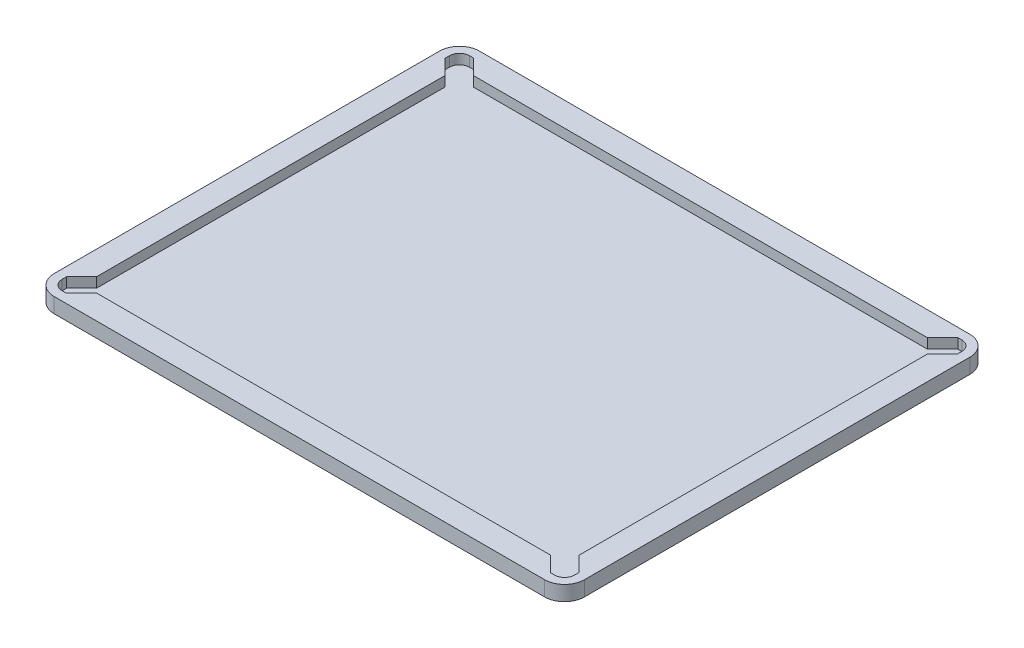
ISO-10303-21;
HEADER;
FILE_DESCRIPTION(('STEP AP214'),'2;1');
FILE_NAME('part.step','',(''),(''),'','','');
FILE_SCHEMA(('AUTOMOTIVE_DESIGN { 1 0 10303 214 1 1 1 1 }'));
ENDSEC;
DATA;
#1=APPLICATION_CONTEXT('core data for automotive mechanical design processes');
#2=APPLICATION_PROTOCOL_DEFINITION('international standard','automotive_design',2000,#1);
#3=PRODUCT_CONTEXT('',#1,'mechanical');
#4=PRODUCT('Part','Part','',(#3));
#5=PRODUCT_RELATED_PRODUCT_CATEGORY('part','',(#4));
#6=PRODUCT_DEFINITION_FORMATION('','',#4);
#7=PRODUCT_DEFINITION_CONTEXT('part definition',#1,'design');
#8=PRODUCT_DEFINITION('design','',#6,#7);
#9=PRODUCT_DEFINITION_SHAPE('','',#8);
#10=(LENGTH_UNIT() NAMED_UNIT(*) SI_UNIT(.MILLI.,.METRE.));
#11=(NAMED_UNIT(*) PLANE_ANGLE_UNIT() SI_UNIT($,.RADIAN.));
#12=(NAMED_UNIT(*) SI_UNIT($,.STERADIAN.) SOLID_ANGLE_UNIT());
#13=UNCERTAINTY_MEASURE_WITH_UNIT(LENGTH_MEASURE(1.E-05),#10,'distance_accuracy_value','');
#14=(GEOMETRIC_REPRESENTATION_CONTEXT(3) GLOBAL_UNCERTAINTY_ASSIGNED_CONTEXT((#13)) GLOBAL_UNIT_ASSIGNED_CONTEXT((#10,
#11,#12)) REPRESENTATION_CONTEXT('',''));
#15=CARTESIAN_POINT('',(0.,0.,0.));
#16=DIRECTION('',(0.,0.,1.));
#17=DIRECTION('',(1.,0.,0.));
#18=AXIS2_PLACEMENT_3D('',#15,#16,#17);
#19=CARTESIAN_POINT('',(0.,7.5,0.));
#20=DIRECTION('',(1.,0.,0.));
#21=DIRECTION('',(0.,0.,-1.));
#22=AXIS2_PLACEMENT_3D('',#19,#20,#21);
#23=PLANE('',#22);
#24=DIRECTION('',(0.,0.,1.));
#25=VECTOR('',#24,1.);
#26=CARTESIAN_POINT('',(0.,0.,0.));
#27=LINE('',#26,#25);
#28=CARTESIAN_POINT('',(0.,0.,-203.3));
#29=VERTEX_POINT('',#28);
#30=CARTESIAN_POINT('',(0.,0.,-10.));
#31=VERTEX_POINT('',#30);
#32=EDGE_CURVE('E288',#29,#31,#27,.T.);
#33=ORIENTED_EDGE('',*,*,#32,.T.);
#34=DIRECTION('',(0.,-1.,0.));
#35=VECTOR('',#34,1.);
#36=CARTESIAN_POINT('',(0.,7.5,-10.));
#37=LINE('',#36,#35);
#38=CARTESIAN_POINT('',(0.,7.5,-10.));
#39=VERTEX_POINT('',#38);
#40=EDGE_CURVE('E11',#31,#39,#37,.F.);
#41=ORIENTED_EDGE('',*,*,#40,.T.);
#42=DIRECTION('',(0.,0.,1.));
#43=VECTOR('',#42,1.);
#44=CARTESIAN_POINT('',(0.,7.5,0.));
#45=LINE('',#44,#43);
#46=CARTESIAN_POINT('',(0.,7.5,-203.3));
#47=VERTEX_POINT('',#46);
#48=EDGE_CURVE('E315',#47,#39,#45,.T.);
#49=ORIENTED_EDGE('',*,*,#48,.F.);
#50=DIRECTION('',(0.,-1.,0.));
#51=VECTOR('',#50,1.);
#52=CARTESIAN_POINT('',(0.,7.5,-203.3));
#53=LINE('',#52,#51);
#54=EDGE_CURVE('E51',#47,#29,#53,.T.);
#55=ORIENTED_EDGE('',*,*,#54,.T.);
#56=EDGE_LOOP('',(#33,#41,#49,#55));
#57=FACE_BOUND('',#56,.T.);
#58=ADVANCED_FACE('F43',(#57),#23,.F.);
#59=CARTESIAN_POINT('',(0.,7.5,0.));
#60=DIRECTION('',(0.,0.,-1.));
#61=DIRECTION('',(-1.,0.,0.));
#62=AXIS2_PLACEMENT_3D('',#59,#60,#61);
#63=PLANE('',#62);
#64=DIRECTION('',(1.,0.,0.));
#65=VECTOR('',#64,1.);
#66=CARTESIAN_POINT('',(0.,0.,0.));
#67=LINE('',#66,#65);
#68=CARTESIAN_POINT('',(10.,0.,0.));
#69=VERTEX_POINT('',#68);
#70=CARTESIAN_POINT('',(256.,0.,0.));
#71=VERTEX_POINT('',#70);
#72=EDGE_CURVE('E293',#69,#71,#67,.T.);
#73=ORIENTED_EDGE('',*,*,#72,.T.);
#74=DIRECTION('',(0.,-1.,0.));
#75=VECTOR('',#74,1.);
#76=CARTESIAN_POINT('',(256.,7.5,0.));
#77=LINE('',#76,#75);
#78=CARTESIAN_POINT('',(256.,7.5,0.));
#79=VERTEX_POINT('',#78);
#80=EDGE_CURVE('E58',#71,#79,#77,.F.);
#81=ORIENTED_EDGE('',*,*,#80,.T.);
#82=DIRECTION('',(1.,0.,0.));
#83=VECTOR('',#82,1.);
#84=CARTESIAN_POINT('',(0.,7.5,0.));
#85=LINE('',#84,#83);
#86=CARTESIAN_POINT('',(10.,7.5,0.));
#87=VERTEX_POINT('',#86);
#88=EDGE_CURVE('E317',#87,#79,#85,.T.);
#89=ORIENTED_EDGE('',*,*,#88,.F.);
#90=DIRECTION('',(0.,-1.,0.));
#91=VECTOR('',#90,1.);
#92=CARTESIAN_POINT('',(10.,7.5,0.));
#93=LINE('',#92,#91);
#94=EDGE_CURVE('E393',#87,#69,#93,.T.);
#95=ORIENTED_EDGE('',*,*,#94,.T.);
#96=EDGE_LOOP('',(#73,#81,#89,#95));
#97=FACE_BOUND('',#96,.T.);
#98=ADVANCED_FACE('F411',(#97),#63,.F.);
#99=CARTESIAN_POINT('',(266.,7.5,0.));
#100=DIRECTION('',(-1.,0.,0.));
#101=DIRECTION('',(0.,0.,1.));
#102=AXIS2_PLACEMENT_3D('',#99,#100,#101);
#103=PLANE('',#102);
#104=DIRECTION('',(0.,0.,-1.));
#105=VECTOR('',#104,1.);
#106=CARTESIAN_POINT('',(266.,0.,0.));
#107=LINE('',#106,#105);
#108=CARTESIAN_POINT('',(266.,0.,-10.));
#109=VERTEX_POINT('',#108);
#110=CARTESIAN_POINT('',(266.,0.,-203.3));
#111=VERTEX_POINT('',#110);
#112=EDGE_CURVE('E328',#109,#111,#107,.T.);
#113=ORIENTED_EDGE('',*,*,#112,.T.);
#114=DIRECTION('',(0.,-1.,0.));
#115=VECTOR('',#114,1.);
#116=CARTESIAN_POINT('',(266.,7.5,-203.3));
#117=LINE('',#116,#115);
#118=CARTESIAN_POINT('',(266.,7.5,-203.3));
#119=VERTEX_POINT('',#118);
#120=EDGE_CURVE('E384',#111,#119,#117,.F.);
#121=ORIENTED_EDGE('',*,*,#120,.T.);
#122=DIRECTION('',(0.,0.,-1.));
#123=VECTOR('',#122,1.);
#124=CARTESIAN_POINT('',(266.,7.5,0.));
#125=LINE('',#124,#123);
#126=CARTESIAN_POINT('',(266.,7.5,-10.));
#127=VERTEX_POINT('',#126);
#128=EDGE_CURVE('E320',#127,#119,#125,.T.);
#129=ORIENTED_EDGE('',*,*,#128,.F.);
#130=DIRECTION('',(0.,-1.,0.));
#131=VECTOR('',#130,1.);
#132=CARTESIAN_POINT('',(266.,7.5,-10.));
#133=LINE('',#132,#131);
#134=EDGE_CURVE('E381',#127,#109,#133,.T.);
#135=ORIENTED_EDGE('',*,*,#134,.T.);
#136=EDGE_LOOP('',(#113,#121,#129,#135));
#137=FACE_BOUND('',#136,.T.);
#138=ADVANCED_FACE('F420',(#137),#103,.F.);
#139=CARTESIAN_POINT('',(0.,7.5,-213.3));
#140=DIRECTION('',(0.,0.,1.));
#141=DIRECTION('',(1.,0.,0.));
#142=AXIS2_PLACEMENT_3D('',#139,#140,#141);
#143=PLANE('',#142);
#144=DIRECTION('',(-1.,0.,0.));
#145=VECTOR('',#144,1.);
#146=CARTESIAN_POINT('',(0.,7.5,-213.3));
#147=LINE('',#146,#145);
#148=CARTESIAN_POINT('',(256.,7.5,-213.3));
#149=VERTEX_POINT('',#148);
#150=CARTESIAN_POINT('',(10.,7.5,-213.3));
#151=VERTEX_POINT('',#150);
#152=EDGE_CURVE('E323',#149,#151,#147,.T.);
#153=ORIENTED_EDGE('',*,*,#152,.F.);
#154=DIRECTION('',(0.,-1.,0.));
#155=VECTOR('',#154,1.);
#156=CARTESIAN_POINT('',(256.,7.5,-213.3));
#157=LINE('',#156,#155);
#158=CARTESIAN_POINT('',(256.,0.,-213.3));
#159=VERTEX_POINT('',#158);
#160=EDGE_CURVE('E370',#149,#159,#157,.T.);
#161=ORIENTED_EDGE('',*,*,#160,.T.);
#162=DIRECTION('',(-1.,0.,0.));
#163=VECTOR('',#162,1.);
#164=CARTESIAN_POINT('',(0.,0.,-213.3));
#165=LINE('',#164,#163);
#166=CARTESIAN_POINT('',(10.,0.,-213.3));
#167=VERTEX_POINT('',#166);
#168=EDGE_CURVE('E318',#159,#167,#165,.T.);
#169=ORIENTED_EDGE('',*,*,#168,.T.);
#170=DIRECTION('',(0.,-1.,0.));
#171=VECTOR('',#170,1.);
#172=CARTESIAN_POINT('',(10.,7.5,-213.3));
#173=LINE('',#172,#171);
#174=EDGE_CURVE('E368',#167,#151,#173,.F.);
#175=ORIENTED_EDGE('',*,*,#174,.T.);
#176=EDGE_LOOP('',(#153,#161,#169,#175));
#177=FACE_BOUND('',#176,.T.);
#178=ADVANCED_FACE('F428',(#177),#143,.F.);
#179=CARTESIAN_POINT('',(0.,7.5,0.));
#180=DIRECTION('',(0.,-1.,0.));
#181=DIRECTION('',(0.,0.,-1.));
#182=AXIS2_PLACEMENT_3D('',#179,#180,#181);
#183=PLANE('',#182);
#184=DIRECTION('',(-1.,0.,0.));
#185=VECTOR('',#184,1.);
#186=CARTESIAN_POINT('',(12.,7.5,-201.15));
#187=LINE('',#186,#185);
#188=CARTESIAN_POINT('',(246.928932188135,7.5,-201.15));
#189=VERTEX_POINT('',#188);
#190=CARTESIAN_POINT('',(19.0710678118655,7.5,-201.15));
#191=VERTEX_POINT('',#190);
#192=EDGE_CURVE('E312',#189,#191,#187,.T.);
#193=ORIENTED_EDGE('',*,*,#192,.F.);
#194=DIRECTION('',(-0.707106781186542,0.,0.707106781186553));
#195=VECTOR('',#194,1.);
#196=CARTESIAN_POINT('',(254.578932188134,7.5,-208.8));
#197=LINE('',#196,#195);
#198=CARTESIAN_POINT('',(254.578932188134,7.5,-208.8));
#199=VERTEX_POINT('',#198);
#200=EDGE_CURVE('E263',#199,#189,#197,.T.);
#201=ORIENTED_EDGE('',*,*,#200,.F.);
#202=DIRECTION('',(-1.,0.,0.));
#203=VECTOR('',#202,1.);
#204=CARTESIAN_POINT('',(261.5,7.5,-208.8));
#205=LINE('',#204,#203);
#206=CARTESIAN_POINT('',(256.5,7.5,-208.8));
#207=VERTEX_POINT('',#206);
#208=EDGE_CURVE('E281',#207,#199,#205,.T.);
#209=ORIENTED_EDGE('',*,*,#208,.F.);
#210=CARTESIAN_POINT('',(256.5,7.5,-203.8));
#211=DIRECTION('',(0.,-1.,0.));
#212=DIRECTION('',(0.,0.,-1.));
#213=AXIS2_PLACEMENT_3D('',#210,#211,#212);
#214=CIRCLE('',#213,5.);
#215=CARTESIAN_POINT('',(261.5,7.5,-203.8));
#216=VERTEX_POINT('',#215);
#217=EDGE_CURVE('E364',#207,#216,#214,.T.);
#218=ORIENTED_EDGE('',*,*,#217,.T.);
#219=DIRECTION('',(0.,0.,-1.));
#220=VECTOR('',#219,1.);
#221=CARTESIAN_POINT('',(261.5,7.5,-201.578932188135));
#222=LINE('',#221,#220);
#223=CARTESIAN_POINT('',(261.5,7.5,-201.578932188135));
#224=VERTEX_POINT('',#223);
#225=EDGE_CURVE('E1044',#224,#216,#222,.T.);
#226=ORIENTED_EDGE('',*,*,#225,.F.);
#227=DIRECTION('',(0.707106781186541,0.,-0.707106781186554));
#228=VECTOR('',#227,1.);
#229=CARTESIAN_POINT('',(254.,7.5,-194.078932188135));
#230=LINE('',#229,#228);
#231=CARTESIAN_POINT('',(254.,7.5,-194.078932188135));
#232=VERTEX_POINT('',#231);
#233=EDGE_CURVE('E1030',#232,#224,#230,.T.);
#234=ORIENTED_EDGE('',*,*,#233,.F.);
#235=DIRECTION('',(0.,0.,-1.));
#236=VECTOR('',#235,1.);
#237=CARTESIAN_POINT('',(254.,7.5,-201.15));
#238=LINE('',#237,#236);
#239=CARTESIAN_POINT('',(254.,7.5,-19.2210678118655));
#240=VERTEX_POINT('',#239);
#241=EDGE_CURVE('E308',#240,#232,#238,.T.);
#242=ORIENTED_EDGE('',*,*,#241,.F.);
#243=DIRECTION('',(-0.70710678118654,0.,-0.707106781186555));
#244=VECTOR('',#243,1.);
#245=CARTESIAN_POINT('',(254.,7.5,-19.2210678118655));
#246=LINE('',#245,#244);
#247=CARTESIAN_POINT('',(261.5,7.5,-11.7210678118653));
#248=VERTEX_POINT('',#247);
#249=EDGE_CURVE('E1017',#248,#240,#246,.T.);
#250=ORIENTED_EDGE('',*,*,#249,.F.);
#251=DIRECTION('',(0.,0.,-1.));
#252=VECTOR('',#251,1.);
#253=CARTESIAN_POINT('',(261.5,7.5,-11.7210678118653));
#254=LINE('',#253,#252);
#255=CARTESIAN_POINT('',(261.5,7.5,-9.50000000000003));
#256=VERTEX_POINT('',#255);
#257=EDGE_CURVE('E1010',#256,#248,#254,.T.);
#258=ORIENTED_EDGE('',*,*,#257,.F.);
#259=CARTESIAN_POINT('',(256.5,7.5,-9.50000000000003));
#260=DIRECTION('',(0.,-1.,0.));
#261=DIRECTION('',(0.,0.,-1.));
#262=AXIS2_PLACEMENT_3D('',#259,#260,#261);
#263=CIRCLE('',#262,5.);
#264=CARTESIAN_POINT('',(256.5,7.5,-4.50000000000002));
#265=VERTEX_POINT('',#264);
#266=EDGE_CURVE('E362',#256,#265,#263,.T.);
#267=ORIENTED_EDGE('',*,*,#266,.T.);
#268=DIRECTION('',(1.,0.,0.));
#269=VECTOR('',#268,1.);
#270=CARTESIAN_POINT('',(261.5,7.5,-4.5));
#271=LINE('',#270,#269);
#272=CARTESIAN_POINT('',(254.578932188134,7.5,-4.50000000000003));
#273=VERTEX_POINT('',#272);
#274=EDGE_CURVE('E1007',#273,#265,#271,.T.);
#275=ORIENTED_EDGE('',*,*,#274,.F.);
#276=DIRECTION('',(0.707106781186542,0.,0.707106781186553));
#277=VECTOR('',#276,1.);
#278=CARTESIAN_POINT('',(254.578932188134,7.5,-4.50000000000003));
#279=LINE('',#278,#277);
#280=CARTESIAN_POINT('',(246.928932188135,7.5,-12.15));
#281=VERTEX_POINT('',#280);
#282=EDGE_CURVE('E1005',#281,#273,#279,.T.);
#283=ORIENTED_EDGE('',*,*,#282,.F.);
#284=DIRECTION('',(1.,0.,0.));
#285=VECTOR('',#284,1.);
#286=CARTESIAN_POINT('',(12.,7.5,-12.1500000000001));
#287=LINE('',#286,#285);
#288=CARTESIAN_POINT('',(19.0710678118655,7.5,-12.15));
#289=VERTEX_POINT('',#288);
#290=EDGE_CURVE('E304',#289,#281,#287,.T.);
#291=ORIENTED_EDGE('',*,*,#290,.F.);
#292=DIRECTION('',(0.707106781186542,0.,-0.707106781186553));
#293=VECTOR('',#292,1.);
#294=CARTESIAN_POINT('',(11.4210678118656,7.5,-4.50000000000003));
#295=LINE('',#294,#293);
#296=CARTESIAN_POINT('',(11.4210678118656,7.5,-4.50000000000003));
#297=VERTEX_POINT('',#296);
#298=EDGE_CURVE('E949',#297,#289,#295,.T.);
#299=ORIENTED_EDGE('',*,*,#298,.F.);
#300=DIRECTION('',(1.,0.,0.));
#301=VECTOR('',#300,1.);
#302=CARTESIAN_POINT('',(4.5,7.5,-4.5));
#303=LINE('',#302,#301);
#304=CARTESIAN_POINT('',(9.50000000000002,7.5,-4.50000000000002));
#305=VERTEX_POINT('',#304);
#306=EDGE_CURVE('E942',#305,#297,#303,.T.);
#307=ORIENTED_EDGE('',*,*,#306,.F.);
#308=CARTESIAN_POINT('',(9.5,7.5,-9.50000000000003));
#309=DIRECTION('',(0.,-1.,0.));
#310=DIRECTION('',(0.,0.,-1.));
#311=AXIS2_PLACEMENT_3D('',#308,#309,#310);
#312=CIRCLE('',#311,5.);
#313=CARTESIAN_POINT('',(4.5,7.5,-9.50000000000003));
#314=VERTEX_POINT('',#313);
#315=EDGE_CURVE('E360',#305,#314,#312,.T.);
#316=ORIENTED_EDGE('',*,*,#315,.T.);
#317=DIRECTION('',(0.,0.,1.));
#318=VECTOR('',#317,1.);
#319=CARTESIAN_POINT('',(4.5,7.5,-11.7210678118653));
#320=LINE('',#319,#318);
#321=CARTESIAN_POINT('',(4.5,7.5,-11.7210678118653));
#322=VERTEX_POINT('',#321);
#323=EDGE_CURVE('E955',#322,#314,#320,.T.);
#324=ORIENTED_EDGE('',*,*,#323,.F.);
#325=DIRECTION('',(-0.70710678118654,0.,0.707106781186555));
#326=VECTOR('',#325,1.);
#327=CARTESIAN_POINT('',(12.,7.5,-19.2210678118655));
#328=LINE('',#327,#326);
#329=CARTESIAN_POINT('',(12.,7.5,-19.2210678118655));
#330=VERTEX_POINT('',#329);
#331=EDGE_CURVE('E951',#330,#322,#328,.T.);
#332=ORIENTED_EDGE('',*,*,#331,.F.);
#333=DIRECTION('',(0.,0.,1.));
#334=VECTOR('',#333,1.);
#335=CARTESIAN_POINT('',(12.,7.5,-201.15));
#336=LINE('',#335,#334);
#337=CARTESIAN_POINT('',(12.,7.5,-194.078932188135));
#338=VERTEX_POINT('',#337);
#339=EDGE_CURVE('E301',#338,#330,#336,.T.);
#340=ORIENTED_EDGE('',*,*,#339,.F.);
#341=DIRECTION('',(0.707106781186541,0.,0.707106781186554));
#342=VECTOR('',#341,1.);
#343=CARTESIAN_POINT('',(12.,7.5,-194.078932188135));
#344=LINE('',#343,#342);
#345=CARTESIAN_POINT('',(4.5,7.5,-201.578932188135));
#346=VERTEX_POINT('',#345);
#347=EDGE_CURVE('E969',#346,#338,#344,.T.);
#348=ORIENTED_EDGE('',*,*,#347,.F.);
#349=DIRECTION('',(0.,0.,1.));
#350=VECTOR('',#349,1.);
#351=CARTESIAN_POINT('',(4.5,7.5,-201.578932188135));
#352=LINE('',#351,#350);
#353=CARTESIAN_POINT('',(4.5,7.5,-203.8));
#354=VERTEX_POINT('',#353);
#355=EDGE_CURVE('E977',#354,#346,#352,.T.);
#356=ORIENTED_EDGE('',*,*,#355,.F.);
#357=CARTESIAN_POINT('',(9.5,7.5,-203.8));
#358=DIRECTION('',(0.,-1.,0.));
#359=DIRECTION('',(0.,0.,-1.));
#360=AXIS2_PLACEMENT_3D('',#357,#358,#359);
#361=CIRCLE('',#360,5.);
#362=CARTESIAN_POINT('',(9.5,7.5,-208.8));
#363=VERTEX_POINT('',#362);
#364=EDGE_CURVE('E366',#354,#363,#361,.T.);
#365=ORIENTED_EDGE('',*,*,#364,.T.);
#366=DIRECTION('',(-1.,0.,0.));
#367=VECTOR('',#366,1.);
#368=CARTESIAN_POINT('',(4.5,7.5,-208.8));
#369=LINE('',#368,#367);
#370=CARTESIAN_POINT('',(11.4210678118656,7.5,-208.8));
#371=VERTEX_POINT('',#370);
#372=EDGE_CURVE('E974',#371,#363,#369,.T.);
#373=ORIENTED_EDGE('',*,*,#372,.F.);
#374=DIRECTION('',(-0.707106781186542,0.,-0.707106781186552));
#375=VECTOR('',#374,1.);
#376=CARTESIAN_POINT('',(11.4210678118656,7.5,-208.8));
#377=LINE('',#376,#375);
#378=EDGE_CURVE('E902',#191,#371,#377,.T.);
#379=ORIENTED_EDGE('',*,*,#378,.F.);
#380=EDGE_LOOP('',(#193,#201,#209,#218,#226,#234,#242,#250,#258,#267,#275,#283,#291,#299,#307,
#316,#324,#332,#340,#348,#356,#365,#373,#379));
#381=FACE_BOUND('',#380,.T.);
#382=ORIENTED_EDGE('',*,*,#128,.T.);
#383=CARTESIAN_POINT('',(256.,7.5,-203.3));
#384=DIRECTION('',(0.,-1.,0.));
#385=DIRECTION('',(0.,0.,-1.));
#386=AXIS2_PLACEMENT_3D('',#383,#384,#385);
#387=CIRCLE('',#386,10.);
#388=EDGE_CURVE('E391',#119,#149,#387,.F.);
#389=ORIENTED_EDGE('',*,*,#388,.T.);
#390=ORIENTED_EDGE('',*,*,#152,.T.);
#391=CARTESIAN_POINT('',(10.,7.5,-203.3));
#392=DIRECTION('',(0.,-1.,0.));
#393=DIRECTION('',(0.,0.,-1.));
#394=AXIS2_PLACEMENT_3D('',#391,#392,#393);
#395=CIRCLE('',#394,10.);
#396=EDGE_CURVE('E386',#151,#47,#395,.F.);
#397=ORIENTED_EDGE('',*,*,#396,.T.);
#398=ORIENTED_EDGE('',*,*,#48,.T.);
#399=CARTESIAN_POINT('',(10.,7.5,-10.));
#400=DIRECTION('',(0.,-1.,0.));
#401=DIRECTION('',(0.,0.,-1.));
#402=AXIS2_PLACEMENT_3D('',#399,#400,#401);
#403=CIRCLE('',#402,10.);
#404=EDGE_CURVE('E65',#39,#87,#403,.F.);
#405=ORIENTED_EDGE('',*,*,#404,.T.);
#406=ORIENTED_EDGE('',*,*,#88,.T.);
#407=CARTESIAN_POINT('',(256.,7.5,-10.));
#408=DIRECTION('',(0.,-1.,0.));
#409=DIRECTION('',(0.,0.,-1.));
#410=AXIS2_PLACEMENT_3D('',#407,#408,#409);
#411=CIRCLE('',#410,10.);
#412=EDGE_CURVE('E389',#79,#127,#411,.F.);
#413=ORIENTED_EDGE('',*,*,#412,.T.);
#414=EDGE_LOOP('',(#382,#389,#390,#397,#398,#405,#406,#413));
#415=FACE_BOUND('',#414,.T.);
#416=ADVANCED_FACE('F413',(#381,#415),#183,.F.);
#417=CARTESIAN_POINT('',(0.,0.,0.));
#418=DIRECTION('',(0.,-1.,0.));
#419=DIRECTION('',(0.,0.,-1.));
#420=AXIS2_PLACEMENT_3D('',#417,#418,#419);
#421=PLANE('',#420);
#422=ORIENTED_EDGE('',*,*,#168,.F.);
#423=CARTESIAN_POINT('',(256.,0.,-203.3));
#424=DIRECTION('',(0.,-1.,0.));
#425=DIRECTION('',(0.,0.,-1.));
#426=AXIS2_PLACEMENT_3D('',#423,#424,#425);
#427=CIRCLE('',#426,10.);
#428=EDGE_CURVE('E379',#159,#111,#427,.T.);
#429=ORIENTED_EDGE('',*,*,#428,.T.);
#430=ORIENTED_EDGE('',*,*,#112,.F.);
#431=CARTESIAN_POINT('',(256.,0.,-10.));
#432=DIRECTION('',(0.,-1.,0.));
#433=DIRECTION('',(0.,0.,-1.));
#434=AXIS2_PLACEMENT_3D('',#431,#432,#433);
#435=CIRCLE('',#434,10.);
#436=EDGE_CURVE('E377',#109,#71,#435,.T.);
#437=ORIENTED_EDGE('',*,*,#436,.T.);
#438=ORIENTED_EDGE('',*,*,#72,.F.);
#439=CARTESIAN_POINT('',(10.,0.,-10.));
#440=DIRECTION('',(0.,-1.,0.));
#441=DIRECTION('',(0.,0.,-1.));
#442=AXIS2_PLACEMENT_3D('',#439,#440,#441);
#443=CIRCLE('',#442,10.);
#444=EDGE_CURVE('E375',#69,#31,#443,.T.);
#445=ORIENTED_EDGE('',*,*,#444,.T.);
#446=ORIENTED_EDGE('',*,*,#32,.F.);
#447=CARTESIAN_POINT('',(10.,0.,-203.3));
#448=DIRECTION('',(0.,-1.,0.));
#449=DIRECTION('',(0.,0.,-1.));
#450=AXIS2_PLACEMENT_3D('',#447,#448,#449);
#451=CIRCLE('',#450,10.);
#452=EDGE_CURVE('E373',#29,#167,#451,.T.);
#453=ORIENTED_EDGE('',*,*,#452,.T.);
#454=EDGE_LOOP('',(#422,#429,#430,#437,#438,#445,#446,#453));
#455=FACE_BOUND('',#454,.T.);
#456=ADVANCED_FACE('F406',(#455),#421,.T.);
#457=CARTESIAN_POINT('',(12.,2.5,-201.15));
#458=DIRECTION('',(-1.,0.,0.));
#459=DIRECTION('',(0.,0.,1.));
#460=AXIS2_PLACEMENT_3D('',#457,#458,#459);
#461=PLANE('',#460);
#462=ORIENTED_EDGE('',*,*,#339,.T.);
#463=DIRECTION('',(0.,1.,0.));
#464=VECTOR('',#463,1.);
#465=CARTESIAN_POINT('',(12.,2.5,-19.2210678118655));
#466=LINE('',#465,#464);
#467=CARTESIAN_POINT('',(12.,2.5,-19.2210678118655));
#468=VERTEX_POINT('',#467);
#469=EDGE_CURVE('E964',#468,#330,#466,.T.);
#470=ORIENTED_EDGE('',*,*,#469,.F.);
#471=DIRECTION('',(0.,0.,1.));
#472=VECTOR('',#471,1.);
#473=CARTESIAN_POINT('',(12.,2.5,-201.15));
#474=LINE('',#473,#472);
#475=CARTESIAN_POINT('',(12.,2.5,-194.078932188135));
#476=VERTEX_POINT('',#475);
#477=EDGE_CURVE('E314',#476,#468,#474,.T.);
#478=ORIENTED_EDGE('',*,*,#477,.F.);
#479=DIRECTION('',(0.,1.,0.));
#480=VECTOR('',#479,1.);
#481=CARTESIAN_POINT('',(12.,2.5,-194.078932188135));
#482=LINE('',#481,#480);
#483=EDGE_CURVE('E305',#476,#338,#482,.T.);
#484=ORIENTED_EDGE('',*,*,#483,.T.);
#485=EDGE_LOOP('',(#462,#470,#478,#484));
#486=FACE_BOUND('',#485,.T.);
#487=ADVANCED_FACE('F662',(#486),#461,.F.);
#488=CARTESIAN_POINT('',(12.,2.5,-201.15));
#489=DIRECTION('',(0.,0.,-1.));
#490=DIRECTION('',(-1.,0.,0.));
#491=AXIS2_PLACEMENT_3D('',#488,#489,#490);
#492=PLANE('',#491);
#493=DIRECTION('',(-1.,0.,0.));
#494=VECTOR('',#493,1.);
#495=CARTESIAN_POINT('',(12.,2.5,-201.15));
#496=LINE('',#495,#494);
#497=CARTESIAN_POINT('',(246.928932188135,2.5,-201.15));
#498=VERTEX_POINT('',#497);
#499=CARTESIAN_POINT('',(19.0710678118655,2.5,-201.15));
#500=VERTEX_POINT('',#499);
#501=EDGE_CURVE('E275',#498,#500,#496,.T.);
#502=ORIENTED_EDGE('',*,*,#501,.F.);
#503=DIRECTION('',(0.,1.,0.));
#504=VECTOR('',#503,1.);
#505=CARTESIAN_POINT('',(246.928932188135,2.5,-201.15));
#506=LINE('',#505,#504);
#507=EDGE_CURVE('E257',#498,#189,#506,.T.);
#508=ORIENTED_EDGE('',*,*,#507,.T.);
#509=ORIENTED_EDGE('',*,*,#192,.T.);
#510=DIRECTION('',(0.,1.,0.));
#511=VECTOR('',#510,1.);
#512=CARTESIAN_POINT('',(19.0710678118655,2.5,-201.15));
#513=LINE('',#512,#511);
#514=EDGE_CURVE('E286',#500,#191,#513,.T.);
#515=ORIENTED_EDGE('',*,*,#514,.F.);
#516=EDGE_LOOP('',(#502,#508,#509,#515));
#517=FACE_BOUND('',#516,.T.);
#518=ADVANCED_FACE('F284',(#517),#492,.F.);
#519=CARTESIAN_POINT('',(254.,2.5,-201.15));
#520=DIRECTION('',(1.,0.,0.));
#521=DIRECTION('',(0.,0.,-1.));
#522=AXIS2_PLACEMENT_3D('',#519,#520,#521);
#523=PLANE('',#522);
#524=ORIENTED_EDGE('',*,*,#241,.T.);
#525=DIRECTION('',(0.,1.,0.));
#526=VECTOR('',#525,1.);
#527=CARTESIAN_POINT('',(254.,2.5,-194.078932188135));
#528=LINE('',#527,#526);
#529=CARTESIAN_POINT('',(254.,2.5,-194.078932188135));
#530=VERTEX_POINT('',#529);
#531=EDGE_CURVE('E268',#530,#232,#528,.T.);
#532=ORIENTED_EDGE('',*,*,#531,.F.);
#533=DIRECTION('',(0.,0.,-1.));
#534=VECTOR('',#533,1.);
#535=CARTESIAN_POINT('',(254.,2.5,-201.15));
#536=LINE('',#535,#534);
#537=CARTESIAN_POINT('',(254.,2.5,-19.2210678118655));
#538=VERTEX_POINT('',#537);
#539=EDGE_CURVE('E289',#538,#530,#536,.T.);
#540=ORIENTED_EDGE('',*,*,#539,.F.);
#541=DIRECTION('',(0.,1.,0.));
#542=VECTOR('',#541,1.);
#543=CARTESIAN_POINT('',(254.,2.5,-19.2210678118655));
#544=LINE('',#543,#542);
#545=EDGE_CURVE('E952',#538,#240,#544,.T.);
#546=ORIENTED_EDGE('',*,*,#545,.T.);
#547=EDGE_LOOP('',(#524,#532,#540,#546));
#548=FACE_BOUND('',#547,.T.);
#549=ADVANCED_FACE('F676',(#548),#523,.F.);
#550=CARTESIAN_POINT('',(12.,2.5,-12.1500000000001));
#551=DIRECTION('',(0.,0.,1.));
#552=DIRECTION('',(1.,0.,0.));
#553=AXIS2_PLACEMENT_3D('',#550,#551,#552);
#554=PLANE('',#553);
#555=ORIENTED_EDGE('',*,*,#290,.T.);
#556=DIRECTION('',(0.,1.,0.));
#557=VECTOR('',#556,1.);
#558=CARTESIAN_POINT('',(246.928932188135,2.5,-12.15));
#559=LINE('',#558,#557);
#560=CARTESIAN_POINT('',(246.928932188135,2.5,-12.15));
#561=VERTEX_POINT('',#560);
#562=EDGE_CURVE('E927',#561,#281,#559,.T.);
#563=ORIENTED_EDGE('',*,*,#562,.F.);
#564=DIRECTION('',(1.,0.,0.));
#565=VECTOR('',#564,1.);
#566=CARTESIAN_POINT('',(12.,2.5,-12.1500000000001));
#567=LINE('',#566,#565);
#568=CARTESIAN_POINT('',(19.0710678118654,2.5,-12.1500000000001));
#569=VERTEX_POINT('',#568);
#570=EDGE_CURVE('E297',#569,#561,#567,.T.);
#571=ORIENTED_EDGE('',*,*,#570,.F.);
#572=DIRECTION('',(0.,1.,0.));
#573=VECTOR('',#572,1.);
#574=CARTESIAN_POINT('',(19.0710678118655,2.5,-12.15));
#575=LINE('',#574,#573);
#576=EDGE_CURVE('E925',#569,#289,#575,.T.);
#577=ORIENTED_EDGE('',*,*,#576,.T.);
#578=EDGE_LOOP('',(#555,#563,#571,#577));
#579=FACE_BOUND('',#578,.T.);
#580=ADVANCED_FACE('F685',(#579),#554,.F.);
#581=CARTESIAN_POINT('',(0.,2.5,0.));
#582=DIRECTION('',(0.,1.,0.));
#583=DIRECTION('',(0.,0.,1.));
#584=AXIS2_PLACEMENT_3D('',#581,#582,#583);
#585=PLANE('',#584);
#586=DIRECTION('',(0.,0.,1.));
#587=VECTOR('',#586,1.);
#588=CARTESIAN_POINT('',(4.5,2.5,-11.7210678118653));
#589=LINE('',#588,#587);
#590=CARTESIAN_POINT('',(4.5,2.5,-11.7210678118653));
#591=VERTEX_POINT('',#590);
#592=CARTESIAN_POINT('',(4.5,2.5,-9.50000000000003));
#593=VERTEX_POINT('',#592);
#594=EDGE_CURVE('E945',#591,#593,#589,.T.);
#595=ORIENTED_EDGE('',*,*,#594,.T.);
#596=CARTESIAN_POINT('',(9.5,2.5,-9.50000000000003));
#597=DIRECTION('',(0.,1.,0.));
#598=DIRECTION('',(0.,0.,1.));
#599=AXIS2_PLACEMENT_3D('',#596,#597,#598);
#600=CIRCLE('',#599,5.);
#601=CARTESIAN_POINT('',(9.50000000000002,2.5,-4.50000000000002));
#602=VERTEX_POINT('',#601);
#603=EDGE_CURVE('E343',#593,#602,#600,.T.);
#604=ORIENTED_EDGE('',*,*,#603,.T.);
#605=DIRECTION('',(1.,0.,0.));
#606=VECTOR('',#605,1.);
#607=CARTESIAN_POINT('',(4.5,2.5,-4.5));
#608=LINE('',#607,#606);
#609=CARTESIAN_POINT('',(11.4210678118656,2.5,-4.50000000000003));
#610=VERTEX_POINT('',#609);
#611=EDGE_CURVE('E947',#602,#610,#608,.T.);
#612=ORIENTED_EDGE('',*,*,#611,.T.);
#613=DIRECTION('',(0.707106781186542,0.,-0.707106781186553));
#614=VECTOR('',#613,1.);
#615=CARTESIAN_POINT('',(11.4210678118656,2.5,-4.50000000000003));
#616=LINE('',#615,#614);
#617=EDGE_CURVE('E921',#610,#569,#616,.T.);
#618=ORIENTED_EDGE('',*,*,#617,.T.);
#619=ORIENTED_EDGE('',*,*,#570,.T.);
#620=DIRECTION('',(0.707106781186542,0.,0.707106781186553));
#621=VECTOR('',#620,1.);
#622=CARTESIAN_POINT('',(254.578932188134,2.5,-4.50000000000003));
#623=LINE('',#622,#621);
#624=CARTESIAN_POINT('',(254.578932188134,2.5,-4.50000000000003));
#625=VERTEX_POINT('',#624);
#626=EDGE_CURVE('E919',#561,#625,#623,.T.);
#627=ORIENTED_EDGE('',*,*,#626,.T.);
#628=DIRECTION('',(1.,0.,0.));
#629=VECTOR('',#628,1.);
#630=CARTESIAN_POINT('',(261.5,2.5,-4.5));
#631=LINE('',#630,#629);
#632=CARTESIAN_POINT('',(256.5,2.5,-4.50000000000002));
#633=VERTEX_POINT('',#632);
#634=EDGE_CURVE('E1036',#625,#633,#631,.T.);
#635=ORIENTED_EDGE('',*,*,#634,.T.);
#636=CARTESIAN_POINT('',(256.5,2.5,-9.50000000000003));
#637=DIRECTION('',(0.,1.,0.));
#638=DIRECTION('',(0.,0.,1.));
#639=AXIS2_PLACEMENT_3D('',#636,#637,#638);
#640=CIRCLE('',#639,5.);
#641=CARTESIAN_POINT('',(261.5,2.5,-9.50000000000003));
#642=VERTEX_POINT('',#641);
#643=EDGE_CURVE('E341',#633,#642,#640,.T.);
#644=ORIENTED_EDGE('',*,*,#643,.T.);
#645=DIRECTION('',(0.,0.,-1.));
#646=VECTOR('',#645,1.);
#647=CARTESIAN_POINT('',(261.5,2.5,-11.7210678118653));
#648=LINE('',#647,#646);
#649=CARTESIAN_POINT('',(261.5,2.5,-11.7210678118653));
#650=VERTEX_POINT('',#649);
#651=EDGE_CURVE('E936',#642,#650,#648,.T.);
#652=ORIENTED_EDGE('',*,*,#651,.T.);
#653=DIRECTION('',(-0.70710678118654,0.,-0.707106781186555));
#654=VECTOR('',#653,1.);
#655=CARTESIAN_POINT('',(254.,2.5,-19.2210678118655));
#656=LINE('',#655,#654);
#657=EDGE_CURVE('E931',#650,#538,#656,.T.);
#658=ORIENTED_EDGE('',*,*,#657,.T.);
#659=ORIENTED_EDGE('',*,*,#539,.T.);
#660=DIRECTION('',(0.707106781186541,0.,-0.707106781186554));
#661=VECTOR('',#660,1.);
#662=CARTESIAN_POINT('',(254.,2.5,-194.078932188135));
#663=LINE('',#662,#661);
#664=CARTESIAN_POINT('',(261.5,2.5,-201.578932188135));
#665=VERTEX_POINT('',#664);
#666=EDGE_CURVE('E280',#530,#665,#663,.T.);
#667=ORIENTED_EDGE('',*,*,#666,.T.);
#668=DIRECTION('',(0.,0.,-1.));
#669=VECTOR('',#668,1.);
#670=CARTESIAN_POINT('',(261.5,2.5,-201.578932188135));
#671=LINE('',#670,#669);
#672=CARTESIAN_POINT('',(261.5,2.5,-203.8));
#673=VERTEX_POINT('',#672);
#674=EDGE_CURVE('E1052',#665,#673,#671,.T.);
#675=ORIENTED_EDGE('',*,*,#674,.T.);
#676=CARTESIAN_POINT('',(256.5,2.5,-203.8));
#677=DIRECTION('',(0.,1.,0.));
#678=DIRECTION('',(0.,0.,1.));
#679=AXIS2_PLACEMENT_3D('',#676,#677,#678);
#680=CIRCLE('',#679,5.);
#681=CARTESIAN_POINT('',(256.5,2.5,-208.8));
#682=VERTEX_POINT('',#681);
#683=EDGE_CURVE('E339',#673,#682,#680,.T.);
#684=ORIENTED_EDGE('',*,*,#683,.T.);
#685=DIRECTION('',(-1.,0.,0.));
#686=VECTOR('',#685,1.);
#687=CARTESIAN_POINT('',(261.5,2.5,-208.8));
#688=LINE('',#687,#686);
#689=CARTESIAN_POINT('',(254.578932188134,2.5,-208.8));
#690=VERTEX_POINT('',#689);
#691=EDGE_CURVE('E269',#682,#690,#688,.T.);
#692=ORIENTED_EDGE('',*,*,#691,.T.);
#693=DIRECTION('',(-0.707106781186542,0.,0.707106781186553));
#694=VECTOR('',#693,1.);
#695=CARTESIAN_POINT('',(254.578932188134,2.5,-208.8));
#696=LINE('',#695,#694);
#697=EDGE_CURVE('E261',#690,#498,#696,.T.);
#698=ORIENTED_EDGE('',*,*,#697,.T.);
#699=ORIENTED_EDGE('',*,*,#501,.T.);
#700=DIRECTION('',(-0.707106781186542,0.,-0.707106781186552));
#701=VECTOR('',#700,1.);
#702=CARTESIAN_POINT('',(11.4210678118656,2.5,-208.8));
#703=LINE('',#702,#701);
#704=CARTESIAN_POINT('',(11.4210678118656,2.5,-208.8));
#705=VERTEX_POINT('',#704);
#706=EDGE_CURVE('E903',#500,#705,#703,.T.);
#707=ORIENTED_EDGE('',*,*,#706,.T.);
#708=DIRECTION('',(-1.,0.,0.));
#709=VECTOR('',#708,1.);
#710=CARTESIAN_POINT('',(4.5,2.5,-208.8));
#711=LINE('',#710,#709);
#712=CARTESIAN_POINT('',(9.5,2.5,-208.8));
#713=VERTEX_POINT('',#712);
#714=EDGE_CURVE('E968',#705,#713,#711,.T.);
#715=ORIENTED_EDGE('',*,*,#714,.T.);
#716=CARTESIAN_POINT('',(9.5,2.5,-203.8));
#717=DIRECTION('',(0.,1.,0.));
#718=DIRECTION('',(0.,0.,1.));
#719=AXIS2_PLACEMENT_3D('',#716,#717,#718);
#720=CIRCLE('',#719,5.);
#721=CARTESIAN_POINT('',(4.5,2.5,-203.8));
#722=VERTEX_POINT('',#721);
#723=EDGE_CURVE('E337',#713,#722,#720,.T.);
#724=ORIENTED_EDGE('',*,*,#723,.T.);
#725=DIRECTION('',(0.,0.,1.));
#726=VECTOR('',#725,1.);
#727=CARTESIAN_POINT('',(4.5,2.5,-201.578932188135));
#728=LINE('',#727,#726);
#729=CARTESIAN_POINT('',(4.5,2.5,-201.578932188135));
#730=VERTEX_POINT('',#729);
#731=EDGE_CURVE('E910',#722,#730,#728,.T.);
#732=ORIENTED_EDGE('',*,*,#731,.T.);
#733=DIRECTION('',(0.707106781186541,0.,0.707106781186554));
#734=VECTOR('',#733,1.);
#735=CARTESIAN_POINT('',(12.,2.5,-194.078932188135));
#736=LINE('',#735,#734);
#737=EDGE_CURVE('E905',#730,#476,#736,.T.);
#738=ORIENTED_EDGE('',*,*,#737,.T.);
#739=ORIENTED_EDGE('',*,*,#477,.T.);
#740=DIRECTION('',(-0.70710678118654,0.,0.707106781186555));
#741=VECTOR('',#740,1.);
#742=CARTESIAN_POINT('',(12.,2.5,-19.2210678118655));
#743=LINE('',#742,#741);
#744=EDGE_CURVE('E941',#468,#591,#743,.T.);
#745=ORIENTED_EDGE('',*,*,#744,.T.);
#746=EDGE_LOOP('',(#595,#604,#612,#618,#619,#627,#635,#644,#652,#658,#659,#667,#675,#684,#692,
#698,#699,#707,#715,#724,#732,#738,#739,#745));
#747=FACE_BOUND('',#746,.T.);
#748=ADVANCED_FACE('F273',(#747),#585,.T.);
#749=CARTESIAN_POINT('',(12.,2.5,-194.078932188135));
#750=DIRECTION('',(-0.707106781186554,0.,0.707106781186541));
#751=DIRECTION('',(0.707106781186541,0.,0.707106781186554));
#752=AXIS2_PLACEMENT_3D('',#749,#750,#751);
#753=PLANE('',#752);
#754=ORIENTED_EDGE('',*,*,#347,.T.);
#755=ORIENTED_EDGE('',*,*,#483,.F.);
#756=ORIENTED_EDGE('',*,*,#737,.F.);
#757=DIRECTION('',(0.,1.,0.));
#758=VECTOR('',#757,1.);
#759=CARTESIAN_POINT('',(4.5,2.5,-201.578932188135));
#760=LINE('',#759,#758);
#761=EDGE_CURVE('E907',#730,#346,#760,.T.);
#762=ORIENTED_EDGE('',*,*,#761,.T.);
#763=EDGE_LOOP('',(#754,#755,#756,#762));
#764=FACE_BOUND('',#763,.T.);
#765=ADVANCED_FACE('F505',(#764),#753,.F.);
#766=CARTESIAN_POINT('',(4.5,2.5,-201.578932188135));
#767=DIRECTION('',(-1.,0.,0.));
#768=DIRECTION('',(0.,0.,1.));
#769=AXIS2_PLACEMENT_3D('',#766,#767,#768);
#770=PLANE('',#769);
#771=ORIENTED_EDGE('',*,*,#731,.F.);
#772=DIRECTION('',(0.,1.,0.));
#773=VECTOR('',#772,1.);
#774=CARTESIAN_POINT('',(4.5,7.5,-203.8));
#775=LINE('',#774,#773);
#776=EDGE_CURVE('E355',#722,#354,#775,.T.);
#777=ORIENTED_EDGE('',*,*,#776,.T.);
#778=ORIENTED_EDGE('',*,*,#355,.T.);
#779=ORIENTED_EDGE('',*,*,#761,.F.);
#780=EDGE_LOOP('',(#771,#777,#778,#779));
#781=FACE_BOUND('',#780,.T.);
#782=ADVANCED_FACE('F509',(#781),#770,.F.);
#783=CARTESIAN_POINT('',(4.5,2.5,-208.8));
#784=DIRECTION('',(0.,0.,-1.));
#785=DIRECTION('',(-1.,0.,0.));
#786=AXIS2_PLACEMENT_3D('',#783,#784,#785);
#787=PLANE('',#786);
#788=ORIENTED_EDGE('',*,*,#372,.T.);
#789=DIRECTION('',(0.,1.,0.));
#790=VECTOR('',#789,1.);
#791=CARTESIAN_POINT('',(9.5,2.5,-208.8));
#792=LINE('',#791,#790);
#793=EDGE_CURVE('E358',#363,#713,#792,.F.);
#794=ORIENTED_EDGE('',*,*,#793,.T.);
#795=ORIENTED_EDGE('',*,*,#714,.F.);
#796=DIRECTION('',(0.,1.,0.));
#797=VECTOR('',#796,1.);
#798=CARTESIAN_POINT('',(11.4210678118656,2.5,-208.8));
#799=LINE('',#798,#797);
#800=EDGE_CURVE('E904',#705,#371,#799,.T.);
#801=ORIENTED_EDGE('',*,*,#800,.T.);
#802=EDGE_LOOP('',(#788,#794,#795,#801));
#803=FACE_BOUND('',#802,.T.);
#804=ADVANCED_FACE('F520',(#803),#787,.F.);
#805=CARTESIAN_POINT('',(11.4210678118656,2.5,-208.8));
#806=DIRECTION('',(0.707106781186552,0.,-0.707106781186542));
#807=DIRECTION('',(-0.707106781186543,0.,-0.707106781186553));
#808=AXIS2_PLACEMENT_3D('',#805,#806,#807);
#809=PLANE('',#808);
#810=ORIENTED_EDGE('',*,*,#378,.T.);
#811=ORIENTED_EDGE('',*,*,#800,.F.);
#812=ORIENTED_EDGE('',*,*,#706,.F.);
#813=ORIENTED_EDGE('',*,*,#514,.T.);
#814=EDGE_LOOP('',(#810,#811,#812,#813));
#815=FACE_BOUND('',#814,.T.);
#816=ADVANCED_FACE('F530',(#815),#809,.F.);
#817=CARTESIAN_POINT('',(11.4210678118656,2.5,-4.50000000000003));
#818=DIRECTION('',(0.707106781186553,0.,0.707106781186542));
#819=DIRECTION('',(0.707106781186542,0.,-0.707106781186553));
#820=AXIS2_PLACEMENT_3D('',#817,#818,#819);
#821=PLANE('',#820);
#822=ORIENTED_EDGE('',*,*,#298,.T.);
#823=ORIENTED_EDGE('',*,*,#576,.F.);
#824=ORIENTED_EDGE('',*,*,#617,.F.);
#825=DIRECTION('',(0.,1.,0.));
#826=VECTOR('',#825,1.);
#827=CARTESIAN_POINT('',(11.4210678118656,2.5,-4.50000000000003));
#828=LINE('',#827,#826);
#829=EDGE_CURVE('E959',#610,#297,#828,.T.);
#830=ORIENTED_EDGE('',*,*,#829,.T.);
#831=EDGE_LOOP('',(#822,#823,#824,#830));
#832=FACE_BOUND('',#831,.T.);
#833=ADVANCED_FACE('F540',(#832),#821,.F.);
#834=CARTESIAN_POINT('',(4.5,2.5,-4.5));
#835=DIRECTION('',(0.,0.,1.));
#836=DIRECTION('',(1.,0.,0.));
#837=AXIS2_PLACEMENT_3D('',#834,#835,#836);
#838=PLANE('',#837);
#839=ORIENTED_EDGE('',*,*,#611,.F.);
#840=DIRECTION('',(0.,1.,0.));
#841=VECTOR('',#840,1.);
#842=CARTESIAN_POINT('',(9.50000000000002,7.5,-4.50000000000002));
#843=LINE('',#842,#841);
#844=EDGE_CURVE('E325',#602,#305,#843,.T.);
#845=ORIENTED_EDGE('',*,*,#844,.T.);
#846=ORIENTED_EDGE('',*,*,#306,.T.);
#847=ORIENTED_EDGE('',*,*,#829,.F.);
#848=EDGE_LOOP('',(#839,#845,#846,#847));
#849=FACE_BOUND('',#848,.T.);
#850=ADVANCED_FACE('F550',(#849),#838,.F.);
#851=CARTESIAN_POINT('',(4.5,2.5,-11.7210678118653));
#852=DIRECTION('',(-1.,0.,0.));
#853=DIRECTION('',(0.,0.,1.));
#854=AXIS2_PLACEMENT_3D('',#851,#852,#853);
#855=PLANE('',#854);
#856=ORIENTED_EDGE('',*,*,#323,.T.);
#857=DIRECTION('',(0.,1.,0.));
#858=VECTOR('',#857,1.);
#859=CARTESIAN_POINT('',(4.5,2.5,-9.50000000000003));
#860=LINE('',#859,#858);
#861=EDGE_CURVE('E335',#314,#593,#860,.F.);
#862=ORIENTED_EDGE('',*,*,#861,.T.);
#863=ORIENTED_EDGE('',*,*,#594,.F.);
#864=DIRECTION('',(0.,1.,0.));
#865=VECTOR('',#864,1.);
#866=CARTESIAN_POINT('',(4.5,2.5,-11.7210678118653));
#867=LINE('',#866,#865);
#868=EDGE_CURVE('E962',#591,#322,#867,.T.);
#869=ORIENTED_EDGE('',*,*,#868,.T.);
#870=EDGE_LOOP('',(#856,#862,#863,#869));
#871=FACE_BOUND('',#870,.T.);
#872=ADVANCED_FACE('F560',(#871),#855,.F.);
#873=CARTESIAN_POINT('',(12.,2.5,-19.2210678118655));
#874=DIRECTION('',(-0.707106781186555,0.,-0.70710678118654));
#875=DIRECTION('',(-0.70710678118654,0.,0.707106781186555));
#876=AXIS2_PLACEMENT_3D('',#873,#874,#875);
#877=PLANE('',#876);
#878=ORIENTED_EDGE('',*,*,#331,.T.);
#879=ORIENTED_EDGE('',*,*,#868,.F.);
#880=ORIENTED_EDGE('',*,*,#744,.F.);
#881=ORIENTED_EDGE('',*,*,#469,.T.);
#882=EDGE_LOOP('',(#878,#879,#880,#881));
#883=FACE_BOUND('',#882,.T.);
#884=ADVANCED_FACE('F570',(#883),#877,.F.);
#885=CARTESIAN_POINT('',(254.,2.5,-19.2210678118655));
#886=DIRECTION('',(0.707106781186555,0.,-0.70710678118654));
#887=DIRECTION('',(-0.70710678118654,0.,-0.707106781186555));
#888=AXIS2_PLACEMENT_3D('',#885,#886,#887);
#889=PLANE('',#888);
#890=ORIENTED_EDGE('',*,*,#249,.T.);
#891=ORIENTED_EDGE('',*,*,#545,.F.);
#892=ORIENTED_EDGE('',*,*,#657,.F.);
#893=DIRECTION('',(0.,1.,0.));
#894=VECTOR('',#893,1.);
#895=CARTESIAN_POINT('',(261.5,2.5,-11.7210678118653));
#896=LINE('',#895,#894);
#897=EDGE_CURVE('E933',#650,#248,#896,.T.);
#898=ORIENTED_EDGE('',*,*,#897,.T.);
#899=EDGE_LOOP('',(#890,#891,#892,#898));
#900=FACE_BOUND('',#899,.T.);
#901=ADVANCED_FACE('F580',(#900),#889,.F.);
#902=CARTESIAN_POINT('',(261.5,2.5,-11.7210678118653));
#903=DIRECTION('',(1.,0.,0.));
#904=DIRECTION('',(0.,0.,-1.));
#905=AXIS2_PLACEMENT_3D('',#902,#903,#904);
#906=PLANE('',#905);
#907=ORIENTED_EDGE('',*,*,#651,.F.);
#908=DIRECTION('',(0.,1.,0.));
#909=VECTOR('',#908,1.);
#910=CARTESIAN_POINT('',(261.5,7.5,-9.50000000000003));
#911=LINE('',#910,#909);
#912=EDGE_CURVE('E345',#642,#256,#911,.T.);
#913=ORIENTED_EDGE('',*,*,#912,.T.);
#914=ORIENTED_EDGE('',*,*,#257,.T.);
#915=ORIENTED_EDGE('',*,*,#897,.F.);
#916=EDGE_LOOP('',(#907,#913,#914,#915));
#917=FACE_BOUND('',#916,.T.);
#918=ADVANCED_FACE('F590',(#917),#906,.F.);
#919=CARTESIAN_POINT('',(261.5,2.5,-4.5));
#920=DIRECTION('',(0.,0.,1.));
#921=DIRECTION('',(1.,0.,0.));
#922=AXIS2_PLACEMENT_3D('',#919,#920,#921);
#923=PLANE('',#922);
#924=ORIENTED_EDGE('',*,*,#274,.T.);
#925=DIRECTION('',(0.,1.,0.));
#926=VECTOR('',#925,1.);
#927=CARTESIAN_POINT('',(256.5,2.5,-4.50000000000002));
#928=LINE('',#927,#926);
#929=EDGE_CURVE('E348',#265,#633,#928,.F.);
#930=ORIENTED_EDGE('',*,*,#929,.T.);
#931=ORIENTED_EDGE('',*,*,#634,.F.);
#932=DIRECTION('',(0.,1.,0.));
#933=VECTOR('',#932,1.);
#934=CARTESIAN_POINT('',(254.578932188134,2.5,-4.50000000000003));
#935=LINE('',#934,#933);
#936=EDGE_CURVE('E930',#625,#273,#935,.T.);
#937=ORIENTED_EDGE('',*,*,#936,.T.);
#938=EDGE_LOOP('',(#924,#930,#931,#937));
#939=FACE_BOUND('',#938,.T.);
#940=ADVANCED_FACE('F600',(#939),#923,.F.);
#941=CARTESIAN_POINT('',(254.578932188134,2.5,-4.50000000000003));
#942=DIRECTION('',(-0.707106781186553,0.,0.707106781186542));
#943=DIRECTION('',(0.707106781186542,0.,0.707106781186553));
#944=AXIS2_PLACEMENT_3D('',#941,#942,#943);
#945=PLANE('',#944);
#946=ORIENTED_EDGE('',*,*,#282,.T.);
#947=ORIENTED_EDGE('',*,*,#936,.F.);
#948=ORIENTED_EDGE('',*,*,#626,.F.);
#949=ORIENTED_EDGE('',*,*,#562,.T.);
#950=EDGE_LOOP('',(#946,#947,#948,#949));
#951=FACE_BOUND('',#950,.T.);
#952=ADVANCED_FACE('F610',(#951),#945,.F.);
#953=CARTESIAN_POINT('',(254.578932188134,2.5,-208.8));
#954=DIRECTION('',(-0.707106781186553,0.,-0.707106781186542));
#955=DIRECTION('',(-0.707106781186542,0.,0.707106781186553));
#956=AXIS2_PLACEMENT_3D('',#953,#954,#955);
#957=PLANE('',#956);
#958=ORIENTED_EDGE('',*,*,#200,.T.);
#959=ORIENTED_EDGE('',*,*,#507,.F.);
#960=ORIENTED_EDGE('',*,*,#697,.F.);
#961=DIRECTION('',(0.,1.,0.));
#962=VECTOR('',#961,1.);
#963=CARTESIAN_POINT('',(254.578932188134,2.5,-208.8));
#964=LINE('',#963,#962);
#965=EDGE_CURVE('E1008',#690,#199,#964,.T.);
#966=ORIENTED_EDGE('',*,*,#965,.T.);
#967=EDGE_LOOP('',(#958,#959,#960,#966));
#968=FACE_BOUND('',#967,.T.);
#969=ADVANCED_FACE('F259',(#968),#957,.F.);
#970=CARTESIAN_POINT('',(261.5,2.5,-208.8));
#971=DIRECTION('',(0.,0.,-1.));
#972=DIRECTION('',(-1.,0.,0.));
#973=AXIS2_PLACEMENT_3D('',#970,#971,#972);
#974=PLANE('',#973);
#975=ORIENTED_EDGE('',*,*,#691,.F.);
#976=DIRECTION('',(0.,1.,0.));
#977=VECTOR('',#976,1.);
#978=CARTESIAN_POINT('',(256.5,7.5,-208.8));
#979=LINE('',#978,#977);
#980=EDGE_CURVE('E350',#682,#207,#979,.T.);
#981=ORIENTED_EDGE('',*,*,#980,.T.);
#982=ORIENTED_EDGE('',*,*,#208,.T.);
#983=ORIENTED_EDGE('',*,*,#965,.F.);
#984=EDGE_LOOP('',(#975,#981,#982,#983));
#985=FACE_BOUND('',#984,.T.);
#986=ADVANCED_FACE('F629',(#985),#974,.F.);
#987=CARTESIAN_POINT('',(261.5,2.5,-201.578932188135));
#988=DIRECTION('',(1.,0.,0.));
#989=DIRECTION('',(0.,0.,-1.));
#990=AXIS2_PLACEMENT_3D('',#987,#988,#989);
#991=PLANE('',#990);
#992=ORIENTED_EDGE('',*,*,#225,.T.);
#993=DIRECTION('',(0.,1.,0.));
#994=VECTOR('',#993,1.);
#995=CARTESIAN_POINT('',(261.5,2.5,-203.8));
#996=LINE('',#995,#994);
#997=EDGE_CURVE('E353',#216,#673,#996,.F.);
#998=ORIENTED_EDGE('',*,*,#997,.T.);
#999=ORIENTED_EDGE('',*,*,#674,.F.);
#1000=DIRECTION('',(0.,1.,0.));
#1001=VECTOR('',#1000,1.);
#1002=CARTESIAN_POINT('',(261.5,2.5,-201.578932188135));
#1003=LINE('',#1002,#1001);
#1004=EDGE_CURVE('E1012',#665,#224,#1003,.T.);
#1005=ORIENTED_EDGE('',*,*,#1004,.T.);
#1006=EDGE_LOOP('',(#992,#998,#999,#1005));
#1007=FACE_BOUND('',#1006,.T.);
#1008=ADVANCED_FACE('F638',(#1007),#991,.F.);
#1009=CARTESIAN_POINT('',(254.,2.5,-194.078932188135));
#1010=DIRECTION('',(0.707106781186554,0.,0.707106781186541));
#1011=DIRECTION('',(0.707106781186541,0.,-0.707106781186554));
#1012=AXIS2_PLACEMENT_3D('',#1009,#1010,#1011);
#1013=PLANE('',#1012);
#1014=ORIENTED_EDGE('',*,*,#233,.T.);
#1015=ORIENTED_EDGE('',*,*,#1004,.F.);
#1016=ORIENTED_EDGE('',*,*,#666,.F.);
#1017=ORIENTED_EDGE('',*,*,#531,.T.);
#1018=EDGE_LOOP('',(#1014,#1015,#1016,#1017));
#1019=FACE_BOUND('',#1018,.T.);
#1020=ADVANCED_FACE('F446',(#1019),#1013,.F.);
#1021=CARTESIAN_POINT('',(9.5,2.5,-9.50000000000003));
#1022=DIRECTION('',(0.,-1.,0.));
#1023=DIRECTION('',(0.,0.,-1.));
#1024=AXIS2_PLACEMENT_3D('',#1021,#1022,#1023);
#1025=CYLINDRICAL_SURFACE('',#1024,5.);
#1026=ORIENTED_EDGE('',*,*,#603,.F.);
#1027=ORIENTED_EDGE('',*,*,#861,.F.);
#1028=ORIENTED_EDGE('',*,*,#315,.F.);
#1029=ORIENTED_EDGE('',*,*,#844,.F.);
#1030=EDGE_LOOP('',(#1026,#1027,#1028,#1029));
#1031=FACE_BOUND('',#1030,.T.);
#1032=ADVANCED_FACE('F442',(#1031),#1025,.F.);
#1033=CARTESIAN_POINT('',(256.5,2.5,-9.50000000000003));
#1034=DIRECTION('',(0.,-1.,0.));
#1035=DIRECTION('',(0.,0.,-1.));
#1036=AXIS2_PLACEMENT_3D('',#1033,#1034,#1035);
#1037=CYLINDRICAL_SURFACE('',#1036,5.);
#1038=ORIENTED_EDGE('',*,*,#643,.F.);
#1039=ORIENTED_EDGE('',*,*,#929,.F.);
#1040=ORIENTED_EDGE('',*,*,#266,.F.);
#1041=ORIENTED_EDGE('',*,*,#912,.F.);
#1042=EDGE_LOOP('',(#1038,#1039,#1040,#1041));
#1043=FACE_BOUND('',#1042,.T.);
#1044=ADVANCED_FACE('F445',(#1043),#1037,.F.);
#1045=CARTESIAN_POINT('',(256.5,2.5,-203.8));
#1046=DIRECTION('',(0.,-1.,0.));
#1047=DIRECTION('',(0.,0.,-1.));
#1048=AXIS2_PLACEMENT_3D('',#1045,#1046,#1047);
#1049=CYLINDRICAL_SURFACE('',#1048,5.);
#1050=ORIENTED_EDGE('',*,*,#683,.F.);
#1051=ORIENTED_EDGE('',*,*,#997,.F.);
#1052=ORIENTED_EDGE('',*,*,#217,.F.);
#1053=ORIENTED_EDGE('',*,*,#980,.F.);
#1054=EDGE_LOOP('',(#1050,#1051,#1052,#1053));
#1055=FACE_BOUND('',#1054,.T.);
#1056=ADVANCED_FACE('F450',(#1055),#1049,.F.);
#1057=CARTESIAN_POINT('',(9.5,2.5,-203.8));
#1058=DIRECTION('',(0.,-1.,0.));
#1059=DIRECTION('',(0.,0.,-1.));
#1060=AXIS2_PLACEMENT_3D('',#1057,#1058,#1059);
#1061=CYLINDRICAL_SURFACE('',#1060,5.);
#1062=ORIENTED_EDGE('',*,*,#723,.F.);
#1063=ORIENTED_EDGE('',*,*,#793,.F.);
#1064=ORIENTED_EDGE('',*,*,#364,.F.);
#1065=ORIENTED_EDGE('',*,*,#776,.F.);
#1066=EDGE_LOOP('',(#1062,#1063,#1064,#1065));
#1067=FACE_BOUND('',#1066,.T.);
#1068=ADVANCED_FACE('F454',(#1067),#1061,.F.);
#1069=CARTESIAN_POINT('',(256.,7.5,-203.3));
#1070=DIRECTION('',(0.,-1.,0.));
#1071=DIRECTION('',(0.,0.,-1.));
#1072=AXIS2_PLACEMENT_3D('',#1069,#1070,#1071);
#1073=CYLINDRICAL_SURFACE('',#1072,10.);
#1074=ORIENTED_EDGE('',*,*,#388,.F.);
#1075=ORIENTED_EDGE('',*,*,#120,.F.);
#1076=ORIENTED_EDGE('',*,*,#428,.F.);
#1077=ORIENTED_EDGE('',*,*,#160,.F.);
#1078=EDGE_LOOP('',(#1074,#1075,#1076,#1077));
#1079=FACE_BOUND('',#1078,.T.);
#1080=ADVANCED_FACE('F425',(#1079),#1073,.T.);
#1081=CARTESIAN_POINT('',(256.,7.5,-10.));
#1082=DIRECTION('',(0.,-1.,0.));
#1083=DIRECTION('',(0.,0.,-1.));
#1084=AXIS2_PLACEMENT_3D('',#1081,#1082,#1083);
#1085=CYLINDRICAL_SURFACE('',#1084,10.);
#1086=ORIENTED_EDGE('',*,*,#412,.F.);
#1087=ORIENTED_EDGE('',*,*,#80,.F.);
#1088=ORIENTED_EDGE('',*,*,#436,.F.);
#1089=ORIENTED_EDGE('',*,*,#134,.F.);
#1090=EDGE_LOOP('',(#1086,#1087,#1088,#1089));
#1091=FACE_BOUND('',#1090,.T.);
#1092=ADVANCED_FACE('F417',(#1091),#1085,.T.);
#1093=CARTESIAN_POINT('',(10.,7.5,-10.));
#1094=DIRECTION('',(0.,-1.,0.));
#1095=DIRECTION('',(0.,0.,-1.));
#1096=AXIS2_PLACEMENT_3D('',#1093,#1094,#1095);
#1097=CYLINDRICAL_SURFACE('',#1096,10.);
#1098=ORIENTED_EDGE('',*,*,#404,.F.);
#1099=ORIENTED_EDGE('',*,*,#40,.F.);
#1100=ORIENTED_EDGE('',*,*,#444,.F.);
#1101=ORIENTED_EDGE('',*,*,#94,.F.);
#1102=EDGE_LOOP('',(#1098,#1099,#1100,#1101));
#1103=FACE_BOUND('',#1102,.T.);
#1104=ADVANCED_FACE('F410',(#1103),#1097,.T.);
#1105=CARTESIAN_POINT('',(10.,7.5,-203.3));
#1106=DIRECTION('',(0.,-1.,0.));
#1107=DIRECTION('',(0.,0.,-1.));
#1108=AXIS2_PLACEMENT_3D('',#1105,#1106,#1107);
#1109=CYLINDRICAL_SURFACE('',#1108,10.);
#1110=ORIENTED_EDGE('',*,*,#396,.F.);
#1111=ORIENTED_EDGE('',*,*,#174,.F.);
#1112=ORIENTED_EDGE('',*,*,#452,.F.);
#1113=ORIENTED_EDGE('',*,*,#54,.F.);
#1114=EDGE_LOOP('',(#1110,#1111,#1112,#1113));
#1115=FACE_BOUND('',#1114,.T.);
#1116=ADVANCED_FACE('F45',(#1115),#1109,.T.);
#1117=CLOSED_SHELL('',(#58,#98,#138,#178,#416,#456,#487,#518,#549,#580,#748,#765,#782,#804,#816,
#833,#850,#872,#884,#901,#918,#940,#952,#969,#986,#1008,#1020,#1032,#1044,#1056,#1068,#1080,
#1092,#1104,#1116));
#1118=MANIFOLD_SOLID_BREP('B2',#1117);
#1119=ADVANCED_BREP_SHAPE_REPRESENTATION('',(#18,#1118),#14);
#1120=SHAPE_DEFINITION_REPRESENTATION(#9,#1119);
ENDSEC;
END-ISO-10303-21;
